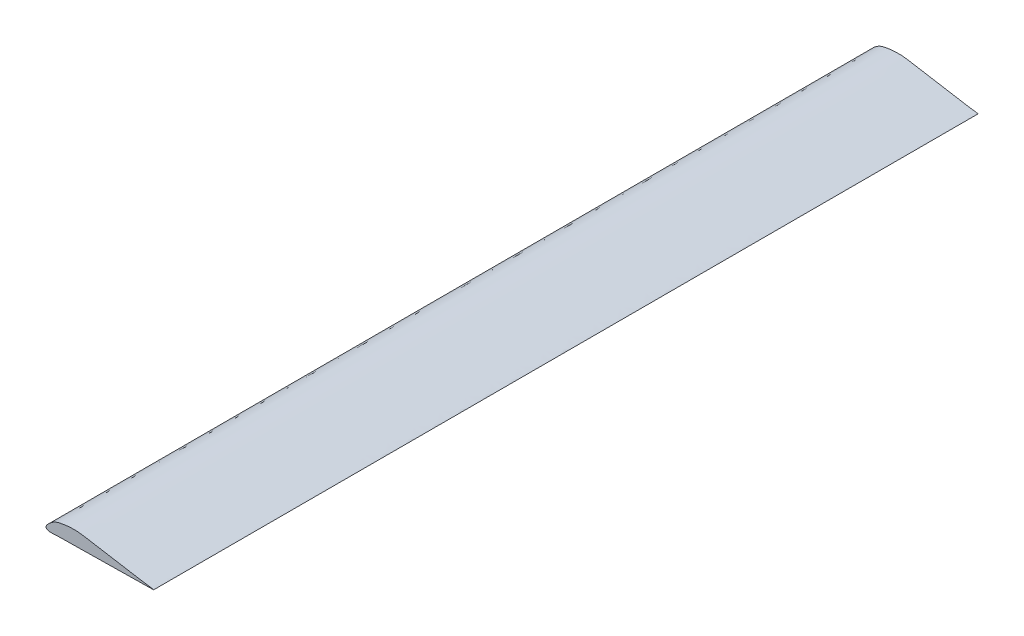
ISO-10303-21;
HEADER;
FILE_DESCRIPTION(('STEP AP214'),'2;1');
FILE_NAME('part.step','',(''),(''),'','','');
FILE_SCHEMA(('AUTOMOTIVE_DESIGN { 1 0 10303 214 1 1 1 1 }'));
ENDSEC;
DATA;
#1=APPLICATION_CONTEXT('core data for automotive mechanical design processes');
#2=APPLICATION_PROTOCOL_DEFINITION('international standard','automotive_design',2000,#1);
#3=PRODUCT_CONTEXT('',#1,'mechanical');
#4=PRODUCT('Part','Part','',(#3));
#5=PRODUCT_RELATED_PRODUCT_CATEGORY('part','',(#4));
#6=PRODUCT_DEFINITION_FORMATION('','',#4);
#7=PRODUCT_DEFINITION_CONTEXT('part definition',#1,'design');
#8=PRODUCT_DEFINITION('design','',#6,#7);
#9=PRODUCT_DEFINITION_SHAPE('','',#8);
#10=(LENGTH_UNIT() NAMED_UNIT(*) SI_UNIT(.MILLI.,.METRE.));
#11=(NAMED_UNIT(*) PLANE_ANGLE_UNIT() SI_UNIT($,.RADIAN.));
#12=(NAMED_UNIT(*) SI_UNIT($,.STERADIAN.) SOLID_ANGLE_UNIT());
#13=UNCERTAINTY_MEASURE_WITH_UNIT(LENGTH_MEASURE(1.E-05),#10,'distance_accuracy_value','');
#14=(GEOMETRIC_REPRESENTATION_CONTEXT(3) GLOBAL_UNCERTAINTY_ASSIGNED_CONTEXT((#13)) GLOBAL_UNIT_ASSIGNED_CONTEXT((#10,
#11,#12)) REPRESENTATION_CONTEXT('',''));
#15=CARTESIAN_POINT('',(0.,0.,0.));
#16=DIRECTION('',(0.,0.,1.));
#17=DIRECTION('',(1.,0.,0.));
#18=AXIS2_PLACEMENT_3D('',#15,#16,#17);
#19=CARTESIAN_POINT('',(76.2,0.,584.2));
#20=CARTESIAN_POINT('',(76.4585835762467,0.180157567136955,584.2));
#21=CARTESIAN_POINT('',(68.5381445592512,1.17334798299896,584.2));
#22=CARTESIAN_POINT('',(63.4400407190194,2.15446774538665,584.2));
#23=CARTESIAN_POINT('',(56.5245388267711,3.27162475637476,584.2));
#24=CARTESIAN_POINT('',(50.0960827956451,4.35329725331238,584.2));
#25=CARTESIAN_POINT('',(43.5368515674611,5.440922149705,584.2));
#26=CARTESIAN_POINT('',(37.0136647901286,6.5401703937544,584.2));
#27=CARTESIAN_POINT('',(30.1204584541441,7.64408335042164,584.2));
#28=CARTESIAN_POINT('',(23.7945768455339,8.86816683883327,584.2));
#29=CARTESIAN_POINT('',(17.6308571957183,8.93841634537931,584.2));
#30=CARTESIAN_POINT('',(12.1414503080905,8.30485448253935,584.2));
#31=CARTESIAN_POINT('',(7.23643098558071,7.31583547501685,584.2));
#32=CARTESIAN_POINT('',(4.06420052798041,5.37609905176891,584.2));
#33=CARTESIAN_POINT('',(2.49686837623147,4.04091954449392,584.2));
#34=CARTESIAN_POINT('',(1.41470678683311,2.93793742882981,584.2));
#35=CARTESIAN_POINT('',(0.40665853931547,1.89690764545079,584.2));
#36=CARTESIAN_POINT('',(-0.434275958108868,0.172470127764011,584.2));
#37=CARTESIAN_POINT('',(0.819206142010687,-0.914452669889594,584.2));
#38=CARTESIAN_POINT('',(3.34539383999259,-1.44403351631885,584.2));
#39=CARTESIAN_POINT('',(7.36396576232299,-0.935694649005908,584.2));
#40=CARTESIAN_POINT('',(12.6463424027724,-1.01338070930237,584.2));
#41=CARTESIAN_POINT('',(17.9458644049906,-0.889048666455099,584.2));
#42=CARTESIAN_POINT('',(23.240799950134,-0.81884669411157,584.2));
#43=CARTESIAN_POINT('',(28.536935844573,-0.734142542213597,584.2));
#44=CARTESIAN_POINT('',(33.8328569163272,-0.653317036515803,584.2));
#45=CARTESIAN_POINT('',(39.1284362639934,-0.571433415928377,584.2));
#46=CARTESIAN_POINT('',(44.4255980353757,-0.489949317792432,584.2));
#47=CARTESIAN_POINT('',(49.7167718359113,-0.407925244722478,584.2));
#48=CARTESIAN_POINT('',(55.0303143911924,-0.327615839781922,584.2));
#49=CARTESIAN_POINT('',(60.2603705644196,-0.241033447039954,584.2));
#50=CARTESIAN_POINT('',(65.8020033953791,-0.177828339313372,584.2));
#51=CARTESIAN_POINT('',(70.1808160805558,-0.0273870764392249,584.2));
#52=CARTESIAN_POINT('',(75.9931600329987,-0.144107316413991,584.2));
#53=CARTESIAN_POINT('',(76.2,0.,584.2));
#54=B_SPLINE_CURVE_WITH_KNOTS('',3,(#19,#20,#21,#22,#23,#24,#25,#26,#27,#28,#29,#30,#31,#32,#33,
#34,#35,#36,#37,#38,#39,#40,#41,#42,#43,#44,#45,#46,#47,#48,#49,#50,#51,#52,#53),.UNSPECIFIED.,
.T.,.F.,(4,1,1,1,1,1,1,1,1,1,1,1,1,1,1,1,1,1,1,1,1,1,1,1,1,1,1,1,1,1,1,1,4),(0.,
0.0421941852328494,0.0843883704656988,0.126582555698548,0.168776701018011,0.21097088625086,
0.25316507148371,0.295359256716559,0.34445924434936,0.376024875016013,0.412649036587989,
0.450339219926448,0.470158470247713,0.482904042385464,0.489771005620349,0.499409247815711,
0.512015316604728,0.518882279839613,0.527486560111009,0.561237519889226,0.594988480415932,
0.628739440194149,0.662490399972365,0.696241359750582,0.729992320277288,0.763743280055505,
0.797494239833721,0.831245200360427,0.864996160138644,0.898747119916861,0.932498079695078,
0.966249040221783,1.),.UNSPECIFIED.);
#55=DIRECTION('',(0.,0.,-1.));
#56=VECTOR('',#55,1.);
#57=SURFACE_OF_LINEAR_EXTRUSION('',#54,#56);
#58=CARTESIAN_POINT('',(76.2,0.,584.2));
#59=VERTEX_POINT('',#58);
#60=EDGE_CURVE('E10',#59,#59,#54,.T.);
#61=ORIENTED_EDGE('',*,*,#60,.F.);
#62=EDGE_LOOP('',(#61));
#63=FACE_BOUND('',#62,.T.);
#64=CARTESIAN_POINT('',(76.2,0.,0.));
#65=CARTESIAN_POINT('',(76.4585835762467,0.180157567136955,0.));
#66=CARTESIAN_POINT('',(68.5381445592512,1.17334798299896,0.));
#67=CARTESIAN_POINT('',(63.4400407190194,2.15446774538665,0.));
#68=CARTESIAN_POINT('',(56.5245388267711,3.27162475637476,0.));
#69=CARTESIAN_POINT('',(50.0960827956451,4.35329725331238,0.));
#70=CARTESIAN_POINT('',(43.5368515674611,5.440922149705,0.));
#71=CARTESIAN_POINT('',(37.0136647901286,6.5401703937544,0.));
#72=CARTESIAN_POINT('',(30.1204584541441,7.64408335042164,0.));
#73=CARTESIAN_POINT('',(23.7945768455339,8.86816683883327,0.));
#74=CARTESIAN_POINT('',(17.6308571957183,8.93841634537931,0.));
#75=CARTESIAN_POINT('',(12.1414503080905,8.30485448253935,0.));
#76=CARTESIAN_POINT('',(7.23643098558071,7.31583547501685,0.));
#77=CARTESIAN_POINT('',(4.06420052798041,5.37609905176891,0.));
#78=CARTESIAN_POINT('',(2.49686837623147,4.04091954449392,0.));
#79=CARTESIAN_POINT('',(1.41470678683311,2.93793742882981,0.));
#80=CARTESIAN_POINT('',(0.40665853931547,1.89690764545079,0.));
#81=CARTESIAN_POINT('',(-0.434275958108868,0.172470127764011,0.));
#82=CARTESIAN_POINT('',(0.819206142010687,-0.914452669889594,0.));
#83=CARTESIAN_POINT('',(3.34539383999259,-1.44403351631885,0.));
#84=CARTESIAN_POINT('',(7.36396576232299,-0.935694649005908,0.));
#85=CARTESIAN_POINT('',(12.6463424027724,-1.01338070930237,0.));
#86=CARTESIAN_POINT('',(17.9458644049906,-0.889048666455099,0.));
#87=CARTESIAN_POINT('',(23.240799950134,-0.81884669411157,0.));
#88=CARTESIAN_POINT('',(28.536935844573,-0.734142542213597,0.));
#89=CARTESIAN_POINT('',(33.8328569163272,-0.653317036515803,0.));
#90=CARTESIAN_POINT('',(39.1284362639934,-0.571433415928377,0.));
#91=CARTESIAN_POINT('',(44.4255980353757,-0.489949317792432,0.));
#92=CARTESIAN_POINT('',(49.7167718359113,-0.407925244722478,0.));
#93=CARTESIAN_POINT('',(55.0303143911924,-0.327615839781922,0.));
#94=CARTESIAN_POINT('',(60.2603705644196,-0.241033447039954,0.));
#95=CARTESIAN_POINT('',(65.8020033953791,-0.177828339313372,0.));
#96=CARTESIAN_POINT('',(70.1808160805558,-0.0273870764392249,0.));
#97=CARTESIAN_POINT('',(75.9931600329987,-0.144107316413991,0.));
#98=CARTESIAN_POINT('',(76.2,0.,0.));
#99=B_SPLINE_CURVE_WITH_KNOTS('',3,(#64,#65,#66,#67,#68,#69,#70,#71,#72,#73,#74,#75,#76,#77,#78,
#79,#80,#81,#82,#83,#84,#85,#86,#87,#88,#89,#90,#91,#92,#93,#94,#95,#96,#97,#98),.UNSPECIFIED.,
.T.,.F.,(4,1,1,1,1,1,1,1,1,1,1,1,1,1,1,1,1,1,1,1,1,1,1,1,1,1,1,1,1,1,1,1,4),(0.,
0.0421941852328494,0.0843883704656988,0.126582555698548,0.168776701018011,0.21097088625086,
0.25316507148371,0.295359256716559,0.34445924434936,0.376024875016013,0.412649036587989,
0.450339219926448,0.470158470247713,0.482904042385464,0.489771005620349,0.499409247815711,
0.512015316604728,0.518882279839613,0.527486560111009,0.561237519889226,0.594988480415932,
0.628739440194149,0.662490399972365,0.696241359750582,0.729992320277288,0.763743280055505,
0.797494239833721,0.831245200360427,0.864996160138644,0.898747119916861,0.932498079695078,
0.966249040221783,1.),.UNSPECIFIED.);
#100=CARTESIAN_POINT('',(76.2,0.,0.));
#101=VERTEX_POINT('',#100);
#102=EDGE_CURVE('E43',#101,#101,#99,.T.);
#103=ORIENTED_EDGE('',*,*,#102,.T.);
#104=EDGE_LOOP('',(#103));
#105=FACE_BOUND('',#104,.T.);
#106=ADVANCED_FACE('F39',(#63,#105),#57,.F.);
#107=CARTESIAN_POINT('',(0.476767206630767,1.82252599981322,584.2));
#108=DIRECTION('',(0.,0.,-1.));
#109=DIRECTION('',(-1.,0.,0.));
#110=AXIS2_PLACEMENT_3D('',#107,#108,#109);
#111=PLANE('',#110);
#112=ORIENTED_EDGE('',*,*,#60,.T.);
#113=EDGE_LOOP('',(#112));
#114=FACE_BOUND('',#113,.T.);
#115=ADVANCED_FACE('F62',(#114),#111,.F.);
#116=CARTESIAN_POINT('',(0.476767206630767,1.82252599981322,0.));
#117=DIRECTION('',(0.,0.,-1.));
#118=DIRECTION('',(-1.,0.,0.));
#119=AXIS2_PLACEMENT_3D('',#116,#117,#118);
#120=PLANE('',#119);
#121=ORIENTED_EDGE('',*,*,#102,.F.);
#122=EDGE_LOOP('',(#121));
#123=FACE_BOUND('',#122,.T.);
#124=ADVANCED_FACE('F60',(#123),#120,.T.);
#125=CLOSED_SHELL('',(#106,#115,#124));
#126=MANIFOLD_SOLID_BREP('B2',#125);
#127=ADVANCED_BREP_SHAPE_REPRESENTATION('',(#18,#126),#14);
#128=SHAPE_DEFINITION_REPRESENTATION(#9,#127);
ENDSEC;
END-ISO-10303-21;
